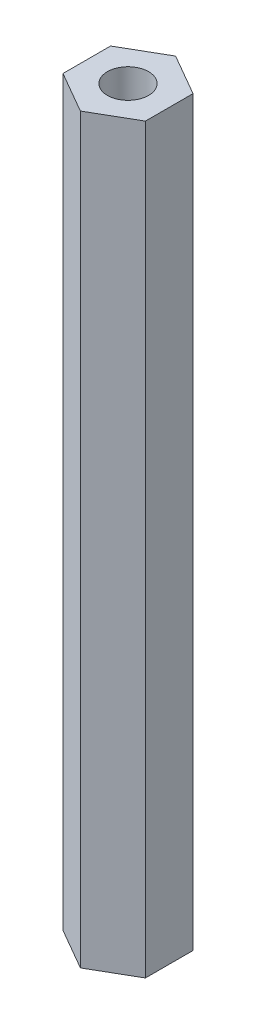
ISO-10303-21;
HEADER;
FILE_DESCRIPTION(('STEP AP214'),'2;1');
FILE_NAME('part.step','',(''),(''),'','','');
FILE_SCHEMA(('AUTOMOTIVE_DESIGN { 1 0 10303 214 1 1 1 1 }'));
ENDSEC;
DATA;
#1=APPLICATION_CONTEXT('core data for automotive mechanical design processes');
#2=APPLICATION_PROTOCOL_DEFINITION('international standard','automotive_design',2000,#1);
#3=PRODUCT_CONTEXT('',#1,'mechanical');
#4=PRODUCT('Part','Part','',(#3));
#5=PRODUCT_RELATED_PRODUCT_CATEGORY('part','',(#4));
#6=PRODUCT_DEFINITION_FORMATION('','',#4);
#7=PRODUCT_DEFINITION_CONTEXT('part definition',#1,'design');
#8=PRODUCT_DEFINITION('design','',#6,#7);
#9=PRODUCT_DEFINITION_SHAPE('','',#8);
#10=(LENGTH_UNIT() NAMED_UNIT(*) SI_UNIT(.MILLI.,.METRE.));
#11=(NAMED_UNIT(*) PLANE_ANGLE_UNIT() SI_UNIT($,.RADIAN.));
#12=(NAMED_UNIT(*) SI_UNIT($,.STERADIAN.) SOLID_ANGLE_UNIT());
#13=UNCERTAINTY_MEASURE_WITH_UNIT(LENGTH_MEASURE(1.E-05),#10,'distance_accuracy_value','');
#14=(GEOMETRIC_REPRESENTATION_CONTEXT(3) GLOBAL_UNCERTAINTY_ASSIGNED_CONTEXT((#13)) GLOBAL_UNIT_ASSIGNED_CONTEXT((#10,
#11,#12)) REPRESENTATION_CONTEXT('',''));
#15=CARTESIAN_POINT('',(0.,0.,0.));
#16=DIRECTION('',(0.,0.,1.));
#17=DIRECTION('',(1.,0.,0.));
#18=AXIS2_PLACEMENT_3D('',#15,#16,#17);
#19=CARTESIAN_POINT('',(2.5,0.,-1.443375672974));
#20=DIRECTION('',(0.500000000000017,0.,-0.866025403784429));
#21=DIRECTION('',(0.,-1.,0.));
#22=AXIS2_PLACEMENT_3D('',#19,#20,#21);
#23=PLANE('',#22);
#24=DIRECTION('',(0.,1.,0.));
#25=VECTOR('',#24,1.);
#26=CARTESIAN_POINT('',(0.,0.,-2.886751345958));
#27=LINE('',#26,#25);
#28=CARTESIAN_POINT('',(0.,0.,-2.886751345948));
#29=VERTEX_POINT('',#28);
#30=CARTESIAN_POINT('',(0.,45.,-2.886751345948));
#31=VERTEX_POINT('',#30);
#32=EDGE_CURVE('E11',#29,#31,#27,.T.);
#33=ORIENTED_EDGE('',*,*,#32,.T.);
#34=DIRECTION('',(-0.866025403783795,0.,-0.500000000001115));
#35=VECTOR('',#34,1.);
#36=CARTESIAN_POINT('',(2.50000000001,45.00000000001,-1.443375672984));
#37=LINE('',#36,#35);
#38=CARTESIAN_POINT('',(2.5,45.,-1.443375672974));
#39=VERTEX_POINT('',#38);
#40=EDGE_CURVE('E23',#39,#31,#37,.T.);
#41=ORIENTED_EDGE('',*,*,#40,.F.);
#42=DIRECTION('',(0.,1.,0.));
#43=VECTOR('',#42,1.);
#44=CARTESIAN_POINT('',(2.50000000001,0.,-1.443375672984));
#45=LINE('',#44,#43);
#46=CARTESIAN_POINT('',(2.5,0.,-1.443375672974));
#47=VERTEX_POINT('',#46);
#48=EDGE_CURVE('E179',#47,#39,#45,.T.);
#49=ORIENTED_EDGE('',*,*,#48,.F.);
#50=DIRECTION('',(-0.866025403783795,0.,-0.500000000001115));
#51=VECTOR('',#50,1.);
#52=CARTESIAN_POINT('',(2.50000000001,0.,-1.443375672984));
#53=LINE('',#52,#51);
#54=EDGE_CURVE('E177',#47,#29,#53,.T.);
#55=ORIENTED_EDGE('',*,*,#54,.T.);
#56=EDGE_LOOP('',(#33,#41,#49,#55));
#57=FACE_BOUND('',#56,.T.);
#58=ADVANCED_FACE('F16',(#57),#23,.T.);
#59=CARTESIAN_POINT('',(2.5,0.,1.443375672974));
#60=DIRECTION('',(1.,0.,0.));
#61=DIRECTION('',(0.,1.,0.));
#62=AXIS2_PLACEMENT_3D('',#59,#60,#61);
#63=PLANE('',#62);
#64=ORIENTED_EDGE('',*,*,#48,.T.);
#65=DIRECTION('',(0.,0.,-1.));
#66=VECTOR('',#65,1.);
#67=CARTESIAN_POINT('',(2.50000000001,45.00000000001,1.443375672984));
#68=LINE('',#67,#66);
#69=CARTESIAN_POINT('',(2.5,45.,1.443375672974));
#70=VERTEX_POINT('',#69);
#71=EDGE_CURVE('E174',#70,#39,#68,.T.);
#72=ORIENTED_EDGE('',*,*,#71,.F.);
#73=DIRECTION('',(0.,1.,0.));
#74=VECTOR('',#73,1.);
#75=CARTESIAN_POINT('',(2.50000000001,0.,1.443375672984));
#76=LINE('',#75,#74);
#77=CARTESIAN_POINT('',(2.5,0.,1.443375672974));
#78=VERTEX_POINT('',#77);
#79=EDGE_CURVE('E171',#78,#70,#76,.T.);
#80=ORIENTED_EDGE('',*,*,#79,.F.);
#81=DIRECTION('',(0.,0.,-1.));
#82=VECTOR('',#81,1.);
#83=CARTESIAN_POINT('',(2.50000000001,0.,1.443375672984));
#84=LINE('',#83,#82);
#85=EDGE_CURVE('E168',#78,#47,#84,.T.);
#86=ORIENTED_EDGE('',*,*,#85,.T.);
#87=EDGE_LOOP('',(#64,#72,#80,#86));
#88=FACE_BOUND('',#87,.T.);
#89=ADVANCED_FACE('F82',(#88),#63,.T.);
#90=CARTESIAN_POINT('',(0.,0.,-2.886751345948));
#91=DIRECTION('',(-0.500000000000017,0.,-0.866025403784429));
#92=DIRECTION('',(-0.866025403784429,0.,0.500000000000017));
#93=AXIS2_PLACEMENT_3D('',#90,#91,#92);
#94=PLANE('',#93);
#95=DIRECTION('',(0.,1.,0.));
#96=VECTOR('',#95,1.);
#97=CARTESIAN_POINT('',(-2.50000000001,0.,-1.443375672984));
#98=LINE('',#97,#96);
#99=CARTESIAN_POINT('',(-2.5,0.,-1.443375672974));
#100=VERTEX_POINT('',#99);
#101=CARTESIAN_POINT('',(-2.5,45.,-1.443375672974));
#102=VERTEX_POINT('',#101);
#103=EDGE_CURVE('E166',#100,#102,#98,.T.);
#104=ORIENTED_EDGE('',*,*,#103,.T.);
#105=DIRECTION('',(-0.866025403783795,0.,0.500000000001115));
#106=VECTOR('',#105,1.);
#107=CARTESIAN_POINT('',(0.,45.00000000001,-2.886751345958));
#108=LINE('',#107,#106);
#109=EDGE_CURVE('E163',#31,#102,#108,.T.);
#110=ORIENTED_EDGE('',*,*,#109,.F.);
#111=ORIENTED_EDGE('',*,*,#32,.F.);
#112=DIRECTION('',(-0.866025403783795,0.,0.500000000001115));
#113=VECTOR('',#112,1.);
#114=CARTESIAN_POINT('',(0.,0.,-2.886751345958));
#115=LINE('',#114,#113);
#116=EDGE_CURVE('E161',#29,#100,#115,.T.);
#117=ORIENTED_EDGE('',*,*,#116,.T.);
#118=EDGE_LOOP('',(#104,#110,#111,#117));
#119=FACE_BOUND('',#118,.T.);
#120=ADVANCED_FACE('F86',(#119),#94,.T.);
#121=CARTESIAN_POINT('',(0.,0.,0.));
#122=DIRECTION('',(0.,1.,0.));
#123=DIRECTION('',(1.,0.,0.));
#124=AXIS2_PLACEMENT_3D('',#121,#122,#123);
#125=PLANE('',#124);
#126=ORIENTED_EDGE('',*,*,#54,.F.);
#127=ORIENTED_EDGE('',*,*,#85,.F.);
#128=DIRECTION('',(0.866025403783795,0.,-0.500000000001115));
#129=VECTOR('',#128,1.);
#130=CARTESIAN_POINT('',(0.,0.,2.886751345958));
#131=LINE('',#130,#129);
#132=CARTESIAN_POINT('',(0.,0.,2.886751345948));
#133=VERTEX_POINT('',#132);
#134=EDGE_CURVE('E158',#133,#78,#131,.T.);
#135=ORIENTED_EDGE('',*,*,#134,.F.);
#136=DIRECTION('',(0.866025403783795,0.,0.500000000001115));
#137=VECTOR('',#136,1.);
#138=CARTESIAN_POINT('',(-2.50000000001,0.,1.443375672984));
#139=LINE('',#138,#137);
#140=CARTESIAN_POINT('',(-2.5,0.,1.443375672974));
#141=VERTEX_POINT('',#140);
#142=EDGE_CURVE('E155',#141,#133,#139,.T.);
#143=ORIENTED_EDGE('',*,*,#142,.F.);
#144=DIRECTION('',(0.,0.,1.));
#145=VECTOR('',#144,1.);
#146=CARTESIAN_POINT('',(-2.50000000001,0.,-1.443375672984));
#147=LINE('',#146,#145);
#148=EDGE_CURVE('E152',#100,#141,#147,.T.);
#149=ORIENTED_EDGE('',*,*,#148,.F.);
#150=ORIENTED_EDGE('',*,*,#116,.F.);
#151=EDGE_LOOP('',(#126,#127,#135,#143,#149,#150));
#152=FACE_BOUND('',#151,.T.);
#153=CARTESIAN_POINT('',(0.,0.,0.));
#154=DIRECTION('',(0.,1.,0.));
#155=DIRECTION('',(-1.,0.,0.));
#156=AXIS2_PLACEMENT_3D('',#153,#154,#155);
#157=CIRCLE('',#156,1.25);
#158=CARTESIAN_POINT('',(-1.25,0.,0.));
#159=VERTEX_POINT('',#158);
#160=EDGE_CURVE('E149',#159,#159,#157,.T.);
#161=ORIENTED_EDGE('',*,*,#160,.T.);
#162=EDGE_LOOP('',(#161));
#163=FACE_BOUND('',#162,.T.);
#164=ADVANCED_FACE('F91',(#152,#163),#125,.F.);
#165=CARTESIAN_POINT('',(0.,0.,2.886751345948));
#166=DIRECTION('',(0.500000000000017,0.,0.866025403784429));
#167=DIRECTION('',(0.,-1.,0.));
#168=AXIS2_PLACEMENT_3D('',#165,#166,#167);
#169=PLANE('',#168);
#170=ORIENTED_EDGE('',*,*,#79,.T.);
#171=DIRECTION('',(0.866025403783795,0.,-0.500000000001115));
#172=VECTOR('',#171,1.);
#173=CARTESIAN_POINT('',(0.,45.00000000001,2.886751345958));
#174=LINE('',#173,#172);
#175=CARTESIAN_POINT('',(0.,45.,2.886751345948));
#176=VERTEX_POINT('',#175);
#177=EDGE_CURVE('E146',#176,#70,#174,.T.);
#178=ORIENTED_EDGE('',*,*,#177,.F.);
#179=DIRECTION('',(0.,1.,0.));
#180=VECTOR('',#179,1.);
#181=CARTESIAN_POINT('',(0.,0.,2.886751345958));
#182=LINE('',#181,#180);
#183=EDGE_CURVE('E143',#133,#176,#182,.T.);
#184=ORIENTED_EDGE('',*,*,#183,.F.);
#185=ORIENTED_EDGE('',*,*,#134,.T.);
#186=EDGE_LOOP('',(#170,#178,#184,#185));
#187=FACE_BOUND('',#186,.T.);
#188=ADVANCED_FACE('F97',(#187),#169,.T.);
#189=CARTESIAN_POINT('',(-2.5,0.,1.443375672974));
#190=DIRECTION('',(-0.500000000000017,0.,0.866025403784429));
#191=DIRECTION('',(0.,1.,0.));
#192=AXIS2_PLACEMENT_3D('',#189,#190,#191);
#193=PLANE('',#192);
#194=ORIENTED_EDGE('',*,*,#183,.T.);
#195=DIRECTION('',(0.866025403783795,0.,0.500000000001115));
#196=VECTOR('',#195,1.);
#197=CARTESIAN_POINT('',(-2.50000000001,45.00000000001,1.443375672984));
#198=LINE('',#197,#196);
#199=CARTESIAN_POINT('',(-2.5,45.,1.443375672974));
#200=VERTEX_POINT('',#199);
#201=EDGE_CURVE('E140',#200,#176,#198,.T.);
#202=ORIENTED_EDGE('',*,*,#201,.F.);
#203=DIRECTION('',(0.,1.,0.));
#204=VECTOR('',#203,1.);
#205=CARTESIAN_POINT('',(-2.50000000001,0.,1.443375672984));
#206=LINE('',#205,#204);
#207=EDGE_CURVE('E137',#141,#200,#206,.T.);
#208=ORIENTED_EDGE('',*,*,#207,.F.);
#209=ORIENTED_EDGE('',*,*,#142,.T.);
#210=EDGE_LOOP('',(#194,#202,#208,#209));
#211=FACE_BOUND('',#210,.T.);
#212=ADVANCED_FACE('F101',(#211),#193,.T.);
#213=CARTESIAN_POINT('',(0.,45.,0.));
#214=DIRECTION('',(0.,1.,0.));
#215=DIRECTION('',(1.,0.,0.));
#216=AXIS2_PLACEMENT_3D('',#213,#214,#215);
#217=PLANE('',#216);
#218=DIRECTION('',(0.,0.,1.));
#219=VECTOR('',#218,1.);
#220=CARTESIAN_POINT('',(-2.50000000001,45.00000000001,-1.443375672984));
#221=LINE('',#220,#219);
#222=EDGE_CURVE('E130',#102,#200,#221,.T.);
#223=ORIENTED_EDGE('',*,*,#222,.T.);
#224=ORIENTED_EDGE('',*,*,#201,.T.);
#225=ORIENTED_EDGE('',*,*,#177,.T.);
#226=ORIENTED_EDGE('',*,*,#71,.T.);
#227=ORIENTED_EDGE('',*,*,#40,.T.);
#228=ORIENTED_EDGE('',*,*,#109,.T.);
#229=EDGE_LOOP('',(#223,#224,#225,#226,#227,#228));
#230=FACE_BOUND('',#229,.T.);
#231=CARTESIAN_POINT('',(0.,45.00000000001,0.));
#232=DIRECTION('',(0.,1.,0.));
#233=DIRECTION('',(-1.,0.,0.));
#234=AXIS2_PLACEMENT_3D('',#231,#232,#233);
#235=CIRCLE('',#234,1.25);
#236=CARTESIAN_POINT('',(-1.25,45.00000000001,0.));
#237=VERTEX_POINT('',#236);
#238=EDGE_CURVE('E126',#237,#237,#235,.T.);
#239=ORIENTED_EDGE('',*,*,#238,.F.);
#240=EDGE_LOOP('',(#239));
#241=FACE_BOUND('',#240,.T.);
#242=ADVANCED_FACE('F105',(#230,#241),#217,.T.);
#243=CARTESIAN_POINT('',(0.,33.71137043753,0.));
#244=DIRECTION('',(0.,-1.,0.));
#245=DIRECTION('',(1.,0.,0.));
#246=AXIS2_PLACEMENT_3D('',#243,#244,#245);
#247=CYLINDRICAL_SURFACE('',#246,1.25);
#248=CARTESIAN_POINT('',(0.,35.00000000001,0.));
#249=DIRECTION('',(0.,1.,0.));
#250=DIRECTION('',(1.,0.,0.));
#251=AXIS2_PLACEMENT_3D('',#248,#249,#250);
#252=CIRCLE('',#251,1.25);
#253=CARTESIAN_POINT('',(1.25,35.00000000001,0.));
#254=VERTEX_POINT('',#253);
#255=EDGE_CURVE('E125',#254,#254,#252,.T.);
#256=ORIENTED_EDGE('',*,*,#255,.F.);
#257=EDGE_LOOP('',(#256));
#258=FACE_BOUND('',#257,.T.);
#259=ORIENTED_EDGE('',*,*,#238,.T.);
#260=EDGE_LOOP('',(#259));
#261=FACE_BOUND('',#260,.T.);
#262=ADVANCED_FACE('F109',(#258,#261),#247,.F.);
#263=CARTESIAN_POINT('',(-2.5,0.,-1.443375672974));
#264=DIRECTION('',(-1.,0.,0.));
#265=DIRECTION('',(0.,0.,1.));
#266=AXIS2_PLACEMENT_3D('',#263,#264,#265);
#267=PLANE('',#266);
#268=ORIENTED_EDGE('',*,*,#207,.T.);
#269=ORIENTED_EDGE('',*,*,#222,.F.);
#270=ORIENTED_EDGE('',*,*,#103,.F.);
#271=ORIENTED_EDGE('',*,*,#148,.T.);
#272=EDGE_LOOP('',(#268,#269,#270,#271));
#273=FACE_BOUND('',#272,.T.);
#274=ADVANCED_FACE('F113',(#273),#267,.T.);
#275=CARTESIAN_POINT('',(0.,34.63856701169,0.));
#276=DIRECTION('',(0.,1.,0.));
#277=DIRECTION('',(1.,0.,0.));
#278=AXIS2_PLACEMENT_3D('',#275,#276,#277);
#279=CONICAL_SURFACE('',#278,0.6484745,1.0297442587);
#280=ORIENTED_EDGE('',*,*,#255,.T.);
#281=EDGE_LOOP('',(#280));
#282=FACE_BOUND('',#281,.T.);
#283=CARTESIAN_POINT('',(0.,34.24892422622,0.));
#284=VERTEX_POINT('',#283);
#285=VERTEX_LOOP('',#284);
#286=FACE_BOUND('',#285,.T.);
#287=ADVANCED_FACE('F77',(#282,#286),#279,.F.);
#288=CARTESIAN_POINT('',(0.,11.28862956247,0.));
#289=DIRECTION('',(0.,-1.,0.));
#290=DIRECTION('',(1.,0.,0.));
#291=AXIS2_PLACEMENT_3D('',#288,#289,#290);
#292=CYLINDRICAL_SURFACE('',#291,1.25);
#293=CARTESIAN_POINT('',(0.,10.00000000001,0.));
#294=DIRECTION('',(0.,1.,0.));
#295=DIRECTION('',(1.,0.,0.));
#296=AXIS2_PLACEMENT_3D('',#293,#294,#295);
#297=CIRCLE('',#296,1.25);
#298=CARTESIAN_POINT('',(1.25,10.00000000001,0.));
#299=VERTEX_POINT('',#298);
#300=EDGE_CURVE('E127',#299,#299,#297,.T.);
#301=ORIENTED_EDGE('',*,*,#300,.T.);
#302=EDGE_LOOP('',(#301));
#303=FACE_BOUND('',#302,.T.);
#304=ORIENTED_EDGE('',*,*,#160,.F.);
#305=EDGE_LOOP('',(#304));
#306=FACE_BOUND('',#305,.T.);
#307=ADVANCED_FACE('F70',(#303,#306),#292,.F.);
#308=CARTESIAN_POINT('',(0.,10.36143298831,0.));
#309=DIRECTION('',(0.,-1.,0.));
#310=DIRECTION('',(-1.,0.,0.));
#311=AXIS2_PLACEMENT_3D('',#308,#309,#310);
#312=CONICAL_SURFACE('',#311,0.6484745,1.0297442587);
#313=ORIENTED_EDGE('',*,*,#300,.F.);
#314=EDGE_LOOP('',(#313));
#315=FACE_BOUND('',#314,.T.);
#316=CARTESIAN_POINT('',(0.,10.75107577378,0.));
#317=VERTEX_POINT('',#316);
#318=VERTEX_LOOP('',#317);
#319=FACE_BOUND('',#318,.T.);
#320=ADVANCED_FACE('F68',(#315,#319),#312,.F.);
#321=CLOSED_SHELL('',(#58,#89,#120,#164,#188,#212,#242,#262,#274,#287,#307,#320));
#322=MANIFOLD_SOLID_BREP('B1',#321);
#323=ADVANCED_BREP_SHAPE_REPRESENTATION('',(#18,#322),#14);
#324=SHAPE_DEFINITION_REPRESENTATION(#9,#323);
ENDSEC;
END-ISO-10303-21;
